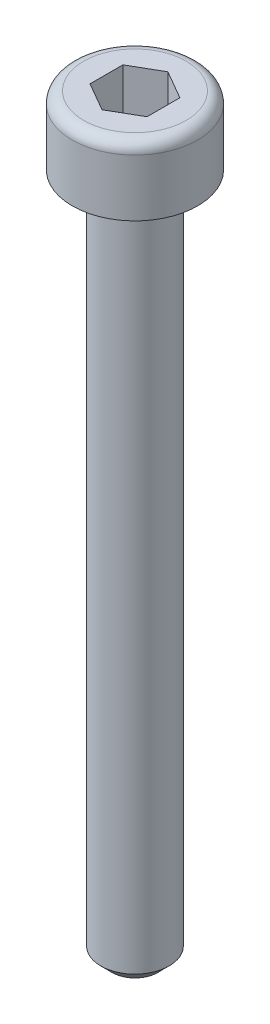
ISO-10303-21;
HEADER;
FILE_DESCRIPTION(('STEP AP214'),'2;1');
FILE_NAME('part.step','',(''),(''),'','','');
FILE_SCHEMA(('AUTOMOTIVE_DESIGN { 1 0 10303 214 1 1 1 1 }'));
ENDSEC;
DATA;
#1=APPLICATION_CONTEXT('core data for automotive mechanical design processes');
#2=APPLICATION_PROTOCOL_DEFINITION('international standard','automotive_design',2000,#1);
#3=PRODUCT_CONTEXT('',#1,'mechanical');
#4=PRODUCT('Part','Part','',(#3));
#5=PRODUCT_RELATED_PRODUCT_CATEGORY('part','',(#4));
#6=PRODUCT_DEFINITION_FORMATION('','',#4);
#7=PRODUCT_DEFINITION_CONTEXT('part definition',#1,'design');
#8=PRODUCT_DEFINITION('design','',#6,#7);
#9=PRODUCT_DEFINITION_SHAPE('','',#8);
#10=(LENGTH_UNIT() NAMED_UNIT(*) SI_UNIT(.MILLI.,.METRE.));
#11=(NAMED_UNIT(*) PLANE_ANGLE_UNIT() SI_UNIT($,.RADIAN.));
#12=(NAMED_UNIT(*) SI_UNIT($,.STERADIAN.) SOLID_ANGLE_UNIT());
#13=UNCERTAINTY_MEASURE_WITH_UNIT(LENGTH_MEASURE(1.E-05),#10,'distance_accuracy_value','');
#14=(GEOMETRIC_REPRESENTATION_CONTEXT(3) GLOBAL_UNCERTAINTY_ASSIGNED_CONTEXT((#13)) GLOBAL_UNIT_ASSIGNED_CONTEXT((#10,
#11,#12)) REPRESENTATION_CONTEXT('',''));
#15=CARTESIAN_POINT('',(0.,0.,0.));
#16=DIRECTION('',(0.,0.,1.));
#17=DIRECTION('',(1.,0.,0.));
#18=AXIS2_PLACEMENT_3D('',#15,#16,#17);
#19=CARTESIAN_POINT('',(0.,0.,0.));
#20=DIRECTION('',(0.,-1.,0.));
#21=DIRECTION('',(0.,0.,-1.));
#22=AXIS2_PLACEMENT_3D('',#19,#20,#21);
#23=PLANE('',#22);
#24=CARTESIAN_POINT('',(0.,0.,0.));
#25=DIRECTION('',(0.,-1.,0.));
#26=DIRECTION('',(0.,0.,-1.));
#27=AXIS2_PLACEMENT_3D('',#24,#25,#26);
#28=CIRCLE('',#27,2.25);
#29=CARTESIAN_POINT('',(0.,0.,-2.25));
#30=VERTEX_POINT('',#29);
#31=EDGE_CURVE('E50',#30,#30,#28,.F.);
#32=ORIENTED_EDGE('',*,*,#31,.T.);
#33=EDGE_LOOP('',(#32));
#34=FACE_BOUND('',#33,.T.);
#35=DIRECTION('',(-0.866025403784439,0.,-0.5));
#36=VECTOR('',#35,1.);
#37=CARTESIAN_POINT('',(1.25,0.,-0.721687836487032));
#38=LINE('',#37,#36);
#39=CARTESIAN_POINT('',(1.25,0.,-0.721687836487032));
#40=VERTEX_POINT('',#39);
#41=CARTESIAN_POINT('',(0.,0.,-1.44337567297406));
#42=VERTEX_POINT('',#41);
#43=EDGE_CURVE('E150',#40,#42,#38,.T.);
#44=ORIENTED_EDGE('',*,*,#43,.F.);
#45=DIRECTION('',(0.,0.,-1.));
#46=VECTOR('',#45,1.);
#47=CARTESIAN_POINT('',(1.25,0.,0.721687836487033));
#48=LINE('',#47,#46);
#49=CARTESIAN_POINT('',(1.25,0.,0.721687836487033));
#50=VERTEX_POINT('',#49);
#51=EDGE_CURVE('E60',#50,#40,#48,.T.);
#52=ORIENTED_EDGE('',*,*,#51,.F.);
#53=DIRECTION('',(0.866025403784439,0.,-0.5));
#54=VECTOR('',#53,1.);
#55=CARTESIAN_POINT('',(0.,0.,1.44337567297406));
#56=LINE('',#55,#54);
#57=CARTESIAN_POINT('',(0.,0.,1.44337567297406));
#58=VERTEX_POINT('',#57);
#59=EDGE_CURVE('E163',#58,#50,#56,.T.);
#60=ORIENTED_EDGE('',*,*,#59,.F.);
#61=DIRECTION('',(0.866025403784439,0.,0.5));
#62=VECTOR('',#61,1.);
#63=CARTESIAN_POINT('',(-1.25,0.,0.721687836487031));
#64=LINE('',#63,#62);
#65=CARTESIAN_POINT('',(-1.25,0.,0.721687836487031));
#66=VERTEX_POINT('',#65);
#67=EDGE_CURVE('E160',#66,#58,#64,.T.);
#68=ORIENTED_EDGE('',*,*,#67,.F.);
#69=DIRECTION('',(0.,0.,1.));
#70=VECTOR('',#69,1.);
#71=CARTESIAN_POINT('',(-1.25,0.,-0.721687836487033));
#72=LINE('',#71,#70);
#73=CARTESIAN_POINT('',(-1.25,0.,-0.721687836487033));
#74=VERTEX_POINT('',#73);
#75=EDGE_CURVE('E117',#74,#66,#72,.T.);
#76=ORIENTED_EDGE('',*,*,#75,.F.);
#77=DIRECTION('',(-0.866025403784439,0.,0.5));
#78=VECTOR('',#77,1.);
#79=CARTESIAN_POINT('',(0.,0.,-1.44337567297406));
#80=LINE('',#79,#78);
#81=EDGE_CURVE('E154',#42,#74,#80,.T.);
#82=ORIENTED_EDGE('',*,*,#81,.F.);
#83=EDGE_LOOP('',(#44,#52,#60,#68,#76,#82));
#84=FACE_BOUND('',#83,.T.);
#85=ADVANCED_FACE('F41',(#34,#84),#23,.F.);
#86=CARTESIAN_POINT('',(0.,0.,0.));
#87=DIRECTION('',(0.,1.,0.));
#88=DIRECTION('',(0.,0.,1.));
#89=AXIS2_PLACEMENT_3D('',#86,#87,#88);
#90=CYLINDRICAL_SURFACE('',#89,2.75);
#91=CARTESIAN_POINT('',(0.,-0.5,0.));
#92=DIRECTION('',(0.,-1.,0.));
#93=DIRECTION('',(0.,0.,-1.));
#94=AXIS2_PLACEMENT_3D('',#91,#92,#93);
#95=CIRCLE('',#94,2.75);
#96=CARTESIAN_POINT('',(0.,-0.5,-2.75));
#97=VERTEX_POINT('',#96);
#98=EDGE_CURVE('E11',#97,#97,#95,.T.);
#99=ORIENTED_EDGE('',*,*,#98,.T.);
#100=EDGE_LOOP('',(#99));
#101=FACE_BOUND('',#100,.T.);
#102=CARTESIAN_POINT('',(0.,-3.,0.));
#103=DIRECTION('',(0.,1.,0.));
#104=DIRECTION('',(0.,0.,1.));
#105=AXIS2_PLACEMENT_3D('',#102,#103,#104);
#106=CIRCLE('',#105,2.75);
#107=CARTESIAN_POINT('',(0.,-3.,2.75));
#108=VERTEX_POINT('',#107);
#109=EDGE_CURVE('E181',#108,#108,#106,.T.);
#110=ORIENTED_EDGE('',*,*,#109,.T.);
#111=EDGE_LOOP('',(#110));
#112=FACE_BOUND('',#111,.T.);
#113=ADVANCED_FACE('F207',(#101,#112),#90,.T.);
#114=CARTESIAN_POINT('',(2.75,-3.,0.));
#115=DIRECTION('',(0.,1.,0.));
#116=DIRECTION('',(0.,0.,1.));
#117=AXIS2_PLACEMENT_3D('',#114,#115,#116);
#118=PLANE('',#117);
#119=ORIENTED_EDGE('',*,*,#109,.F.);
#120=EDGE_LOOP('',(#119));
#121=FACE_BOUND('',#120,.T.);
#122=CARTESIAN_POINT('',(0.,-3.,0.));
#123=DIRECTION('',(0.,1.,0.));
#124=DIRECTION('',(0.,0.,1.));
#125=AXIS2_PLACEMENT_3D('',#122,#123,#124);
#126=CIRCLE('',#125,1.5);
#127=CARTESIAN_POINT('',(0.,-3.,1.5));
#128=VERTEX_POINT('',#127);
#129=EDGE_CURVE('E169',#128,#128,#126,.T.);
#130=ORIENTED_EDGE('',*,*,#129,.T.);
#131=EDGE_LOOP('',(#130));
#132=FACE_BOUND('',#131,.T.);
#133=ADVANCED_FACE('F212',(#121,#132),#118,.F.);
#134=CARTESIAN_POINT('',(0.,0.,0.));
#135=DIRECTION('',(0.,1.,0.));
#136=DIRECTION('',(0.,0.,1.));
#137=AXIS2_PLACEMENT_3D('',#134,#135,#136);
#138=CYLINDRICAL_SURFACE('',#137,1.5);
#139=CARTESIAN_POINT('',(0.,-32.5,0.));
#140=DIRECTION('',(0.,1.,0.));
#141=DIRECTION('',(0.,0.,1.));
#142=AXIS2_PLACEMENT_3D('',#139,#140,#141);
#143=CIRCLE('',#142,1.5);
#144=CARTESIAN_POINT('',(0.,-32.5,1.5));
#145=VERTEX_POINT('',#144);
#146=EDGE_CURVE('E185',#145,#145,#143,.T.);
#147=ORIENTED_EDGE('',*,*,#146,.T.);
#148=EDGE_LOOP('',(#147));
#149=FACE_BOUND('',#148,.T.);
#150=ORIENTED_EDGE('',*,*,#129,.F.);
#151=EDGE_LOOP('',(#150));
#152=FACE_BOUND('',#151,.T.);
#153=ADVANCED_FACE('F218',(#149,#152),#138,.T.);
#154=CARTESIAN_POINT('',(1.5,-33.,0.));
#155=DIRECTION('',(0.,1.,0.));
#156=DIRECTION('',(0.,0.,1.));
#157=AXIS2_PLACEMENT_3D('',#154,#155,#156);
#158=PLANE('',#157);
#159=CARTESIAN_POINT('',(0.,-33.,0.));
#160=DIRECTION('',(0.,1.,0.));
#161=DIRECTION('',(0.,0.,1.));
#162=AXIS2_PLACEMENT_3D('',#159,#160,#161);
#163=CIRCLE('',#162,1.);
#164=CARTESIAN_POINT('',(0.,-33.,1.));
#165=VERTEX_POINT('',#164);
#166=EDGE_CURVE('E189',#165,#165,#163,.F.);
#167=ORIENTED_EDGE('',*,*,#166,.T.);
#168=EDGE_LOOP('',(#167));
#169=FACE_BOUND('',#168,.T.);
#170=ADVANCED_FACE('F222',(#169),#158,.F.);
#171=CARTESIAN_POINT('',(1.25,-2.,0.721687836487033));
#172=DIRECTION('',(1.,0.,0.));
#173=DIRECTION('',(0.,0.,-1.));
#174=AXIS2_PLACEMENT_3D('',#171,#172,#173);
#175=PLANE('',#174);
#176=ORIENTED_EDGE('',*,*,#51,.T.);
#177=DIRECTION('',(0.,1.,0.));
#178=VECTOR('',#177,1.);
#179=CARTESIAN_POINT('',(1.25,-2.,-0.721687836487032));
#180=LINE('',#179,#178);
#181=CARTESIAN_POINT('',(1.25,-2.,-0.721687836487032));
#182=VERTEX_POINT('',#181);
#183=EDGE_CURVE('E98',#182,#40,#180,.T.);
#184=ORIENTED_EDGE('',*,*,#183,.F.);
#185=DIRECTION('',(0.,0.,-1.));
#186=VECTOR('',#185,1.);
#187=CARTESIAN_POINT('',(1.25,-2.,0.721687836487033));
#188=LINE('',#187,#186);
#189=CARTESIAN_POINT('',(1.25,-2.,0.721687836487033));
#190=VERTEX_POINT('',#189);
#191=EDGE_CURVE('E166',#190,#182,#188,.T.);
#192=ORIENTED_EDGE('',*,*,#191,.F.);
#193=DIRECTION('',(0.,1.,0.));
#194=VECTOR('',#193,1.);
#195=CARTESIAN_POINT('',(1.25,-2.,0.721687836487033));
#196=LINE('',#195,#194);
#197=EDGE_CURVE('E71',#190,#50,#196,.T.);
#198=ORIENTED_EDGE('',*,*,#197,.T.);
#199=EDGE_LOOP('',(#176,#184,#192,#198));
#200=FACE_BOUND('',#199,.T.);
#201=ADVANCED_FACE('F226',(#200),#175,.F.);
#202=CARTESIAN_POINT('',(0.,-2.,1.44337567297406));
#203=DIRECTION('',(0.5,0.,0.866025403784439));
#204=DIRECTION('',(0.866025403784439,0.,-0.5));
#205=AXIS2_PLACEMENT_3D('',#202,#203,#204);
#206=PLANE('',#205);
#207=ORIENTED_EDGE('',*,*,#59,.T.);
#208=ORIENTED_EDGE('',*,*,#197,.F.);
#209=DIRECTION('',(0.866025403784439,0.,-0.5));
#210=VECTOR('',#209,1.);
#211=CARTESIAN_POINT('',(0.,-2.,1.44337567297406));
#212=LINE('',#211,#210);
#213=CARTESIAN_POINT('',(0.,-2.,1.44337567297406));
#214=VERTEX_POINT('',#213);
#215=EDGE_CURVE('E131',#214,#190,#212,.T.);
#216=ORIENTED_EDGE('',*,*,#215,.F.);
#217=DIRECTION('',(0.,1.,0.));
#218=VECTOR('',#217,1.);
#219=CARTESIAN_POINT('',(0.,-2.,1.44337567297406));
#220=LINE('',#219,#218);
#221=EDGE_CURVE('E122',#214,#58,#220,.T.);
#222=ORIENTED_EDGE('',*,*,#221,.T.);
#223=EDGE_LOOP('',(#207,#208,#216,#222));
#224=FACE_BOUND('',#223,.T.);
#225=ADVANCED_FACE('F230',(#224),#206,.F.);
#226=CARTESIAN_POINT('',(-1.25,-2.,0.721687836487031));
#227=DIRECTION('',(-0.5,0.,0.866025403784439));
#228=DIRECTION('',(0.866025403784439,0.,0.5));
#229=AXIS2_PLACEMENT_3D('',#226,#227,#228);
#230=PLANE('',#229);
#231=ORIENTED_EDGE('',*,*,#67,.T.);
#232=ORIENTED_EDGE('',*,*,#221,.F.);
#233=DIRECTION('',(0.866025403784439,0.,0.5));
#234=VECTOR('',#233,1.);
#235=CARTESIAN_POINT('',(-1.25,-2.,0.721687836487031));
#236=LINE('',#235,#234);
#237=CARTESIAN_POINT('',(-1.25,-2.,0.721687836487031));
#238=VERTEX_POINT('',#237);
#239=EDGE_CURVE('E126',#238,#214,#236,.T.);
#240=ORIENTED_EDGE('',*,*,#239,.F.);
#241=DIRECTION('',(0.,1.,0.));
#242=VECTOR('',#241,1.);
#243=CARTESIAN_POINT('',(-1.25,-2.,0.721687836487031));
#244=LINE('',#243,#242);
#245=EDGE_CURVE('E110',#238,#66,#244,.T.);
#246=ORIENTED_EDGE('',*,*,#245,.T.);
#247=EDGE_LOOP('',(#231,#232,#240,#246));
#248=FACE_BOUND('',#247,.T.);
#249=ADVANCED_FACE('F127',(#248),#230,.F.);
#250=CARTESIAN_POINT('',(-1.25,-2.,-0.721687836487033));
#251=DIRECTION('',(-1.,0.,0.));
#252=DIRECTION('',(0.,0.,1.));
#253=AXIS2_PLACEMENT_3D('',#250,#251,#252);
#254=PLANE('',#253);
#255=ORIENTED_EDGE('',*,*,#75,.T.);
#256=ORIENTED_EDGE('',*,*,#245,.F.);
#257=DIRECTION('',(0.,0.,1.));
#258=VECTOR('',#257,1.);
#259=CARTESIAN_POINT('',(-1.25,-2.,-0.721687836487033));
#260=LINE('',#259,#258);
#261=CARTESIAN_POINT('',(-1.25,-2.,-0.721687836487033));
#262=VERTEX_POINT('',#261);
#263=EDGE_CURVE('E114',#262,#238,#260,.T.);
#264=ORIENTED_EDGE('',*,*,#263,.F.);
#265=DIRECTION('',(0.,1.,0.));
#266=VECTOR('',#265,1.);
#267=CARTESIAN_POINT('',(-1.25,-2.,-0.721687836487033));
#268=LINE('',#267,#266);
#269=EDGE_CURVE('E123',#262,#74,#268,.T.);
#270=ORIENTED_EDGE('',*,*,#269,.T.);
#271=EDGE_LOOP('',(#255,#256,#264,#270));
#272=FACE_BOUND('',#271,.T.);
#273=ADVANCED_FACE('F112',(#272),#254,.F.);
#274=CARTESIAN_POINT('',(0.,-2.,-1.44337567297406));
#275=DIRECTION('',(-0.5,0.,-0.866025403784439));
#276=DIRECTION('',(-0.866025403784439,0.,0.5));
#277=AXIS2_PLACEMENT_3D('',#274,#275,#276);
#278=PLANE('',#277);
#279=ORIENTED_EDGE('',*,*,#81,.T.);
#280=ORIENTED_EDGE('',*,*,#269,.F.);
#281=DIRECTION('',(-0.866025403784439,0.,0.5));
#282=VECTOR('',#281,1.);
#283=CARTESIAN_POINT('',(0.,-2.,-1.44337567297406));
#284=LINE('',#283,#282);
#285=CARTESIAN_POINT('',(0.,-2.,-1.44337567297406));
#286=VERTEX_POINT('',#285);
#287=EDGE_CURVE('E137',#286,#262,#284,.T.);
#288=ORIENTED_EDGE('',*,*,#287,.F.);
#289=DIRECTION('',(0.,1.,0.));
#290=VECTOR('',#289,1.);
#291=CARTESIAN_POINT('',(0.,-2.,-1.44337567297406));
#292=LINE('',#291,#290);
#293=EDGE_CURVE('E173',#286,#42,#292,.T.);
#294=ORIENTED_EDGE('',*,*,#293,.T.);
#295=EDGE_LOOP('',(#279,#280,#288,#294));
#296=FACE_BOUND('',#295,.T.);
#297=ADVANCED_FACE('F234',(#296),#278,.F.);
#298=CARTESIAN_POINT('',(1.25,-2.,-0.721687836487032));
#299=DIRECTION('',(0.5,0.,-0.866025403784439));
#300=DIRECTION('',(-0.866025403784439,0.,-0.5));
#301=AXIS2_PLACEMENT_3D('',#298,#299,#300);
#302=PLANE('',#301);
#303=ORIENTED_EDGE('',*,*,#43,.T.);
#304=ORIENTED_EDGE('',*,*,#293,.F.);
#305=DIRECTION('',(-0.866025403784439,0.,-0.5));
#306=VECTOR('',#305,1.);
#307=CARTESIAN_POINT('',(1.25,-2.,-0.721687836487032));
#308=LINE('',#307,#306);
#309=EDGE_CURVE('E143',#182,#286,#308,.T.);
#310=ORIENTED_EDGE('',*,*,#309,.F.);
#311=ORIENTED_EDGE('',*,*,#183,.T.);
#312=EDGE_LOOP('',(#303,#304,#310,#311));
#313=FACE_BOUND('',#312,.T.);
#314=ADVANCED_FACE('F231',(#313),#302,.F.);
#315=CARTESIAN_POINT('',(1.25,-2.,-0.721687836487032));
#316=DIRECTION('',(0.,1.,0.));
#317=DIRECTION('',(0.,0.,1.));
#318=AXIS2_PLACEMENT_3D('',#315,#316,#317);
#319=PLANE('',#318);
#320=ORIENTED_EDGE('',*,*,#191,.T.);
#321=ORIENTED_EDGE('',*,*,#309,.T.);
#322=ORIENTED_EDGE('',*,*,#287,.T.);
#323=ORIENTED_EDGE('',*,*,#263,.T.);
#324=ORIENTED_EDGE('',*,*,#239,.T.);
#325=ORIENTED_EDGE('',*,*,#215,.T.);
#326=EDGE_LOOP('',(#320,#321,#322,#323,#324,#325));
#327=FACE_BOUND('',#326,.T.);
#328=ADVANCED_FACE('F134',(#327),#319,.T.);
#329=CARTESIAN_POINT('',(0.,-32.5,0.));
#330=DIRECTION('',(0.,1.,0.));
#331=DIRECTION('',(0.,0.,1.));
#332=AXIS2_PLACEMENT_3D('',#329,#330,#331);
#333=CONICAL_SURFACE('',#332,1.5,0.785398163397446);
#334=ORIENTED_EDGE('',*,*,#166,.F.);
#335=EDGE_LOOP('',(#334));
#336=FACE_BOUND('',#335,.T.);
#337=ORIENTED_EDGE('',*,*,#146,.F.);
#338=EDGE_LOOP('',(#337));
#339=FACE_BOUND('',#338,.T.);
#340=ADVANCED_FACE('F199',(#336,#339),#333,.T.);
#341=CARTESIAN_POINT('',(0.,-0.5,0.));
#342=DIRECTION('',(0.,-1.,0.));
#343=DIRECTION('',(0.,0.,-1.));
#344=AXIS2_PLACEMENT_3D('',#341,#342,#343);
#345=TOROIDAL_SURFACE('',#344,2.25,0.5);
#346=ORIENTED_EDGE('',*,*,#98,.F.);
#347=EDGE_LOOP('',(#346));
#348=FACE_BOUND('',#347,.T.);
#349=ORIENTED_EDGE('',*,*,#31,.F.);
#350=EDGE_LOOP('',(#349));
#351=FACE_BOUND('',#350,.T.);
#352=ADVANCED_FACE('F43',(#348,#351),#345,.T.);
#353=CLOSED_SHELL('',(#85,#113,#133,#153,#170,#201,#225,#249,#273,#297,#314,#328,#340,#352));
#354=MANIFOLD_SOLID_BREP('B2',#353);
#355=ADVANCED_BREP_SHAPE_REPRESENTATION('',(#18,#354),#14);
#356=SHAPE_DEFINITION_REPRESENTATION(#9,#355);
ENDSEC;
END-ISO-10303-21;
